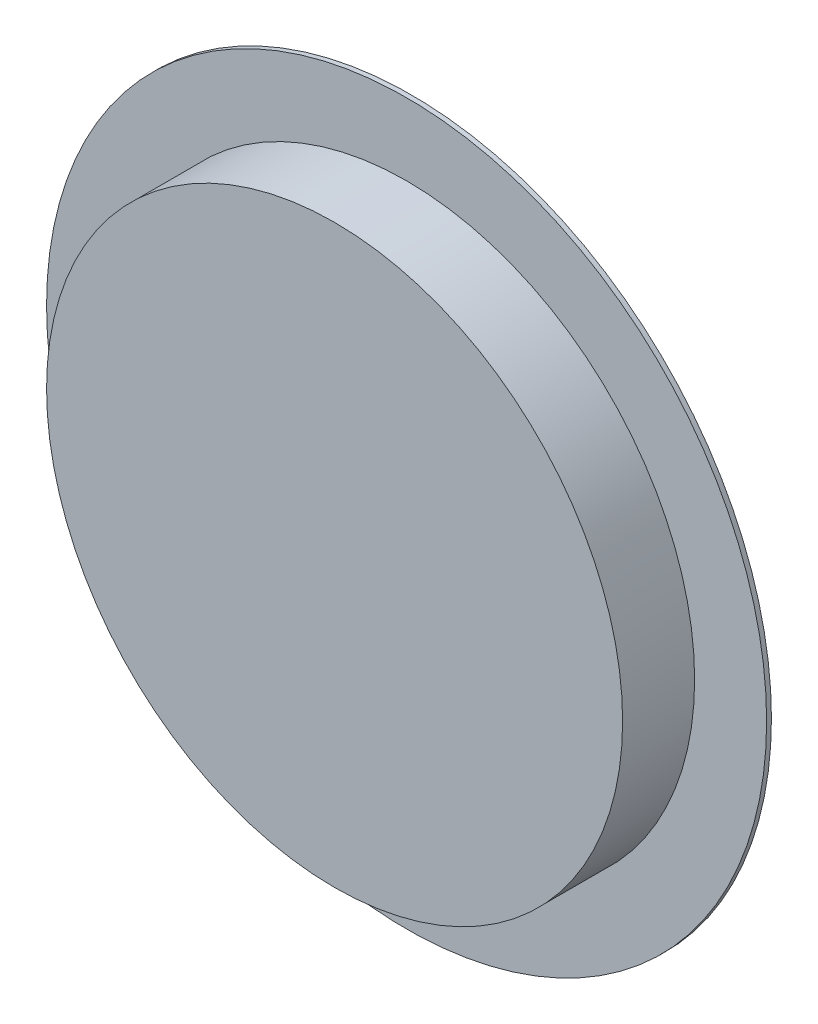
ISO-10303-21;
HEADER;
FILE_DESCRIPTION(('STEP AP214'),'2;1');
FILE_NAME('part.step','',(''),(''),'','','');
FILE_SCHEMA(('AUTOMOTIVE_DESIGN { 1 0 10303 214 1 1 1 1 }'));
ENDSEC;
DATA;
#1=APPLICATION_CONTEXT('core data for automotive mechanical design processes');
#2=APPLICATION_PROTOCOL_DEFINITION('international standard','automotive_design',2000,#1);
#3=PRODUCT_CONTEXT('',#1,'mechanical');
#4=PRODUCT('Part','Part','',(#3));
#5=PRODUCT_RELATED_PRODUCT_CATEGORY('part','',(#4));
#6=PRODUCT_DEFINITION_FORMATION('','',#4);
#7=PRODUCT_DEFINITION_CONTEXT('part definition',#1,'design');
#8=PRODUCT_DEFINITION('design','',#6,#7);
#9=PRODUCT_DEFINITION_SHAPE('','',#8);
#10=(LENGTH_UNIT() NAMED_UNIT(*) SI_UNIT(.MILLI.,.METRE.));
#11=(NAMED_UNIT(*) PLANE_ANGLE_UNIT() SI_UNIT($,.RADIAN.));
#12=(NAMED_UNIT(*) SI_UNIT($,.STERADIAN.) SOLID_ANGLE_UNIT());
#13=UNCERTAINTY_MEASURE_WITH_UNIT(LENGTH_MEASURE(1.E-05),#10,'distance_accuracy_value','');
#14=(GEOMETRIC_REPRESENTATION_CONTEXT(3) GLOBAL_UNCERTAINTY_ASSIGNED_CONTEXT((#13)) GLOBAL_UNIT_ASSIGNED_CONTEXT((#10,
#11,#12)) REPRESENTATION_CONTEXT('',''));
#15=CARTESIAN_POINT('',(0.,0.,0.));
#16=DIRECTION('',(0.,0.,1.));
#17=DIRECTION('',(1.,0.,0.));
#18=AXIS2_PLACEMENT_3D('',#15,#16,#17);
#19=CARTESIAN_POINT('',(0.,0.,1.));
#20=DIRECTION('',(0.,0.,1.));
#21=DIRECTION('',(1.,0.,0.));
#22=AXIS2_PLACEMENT_3D('',#19,#20,#21);
#23=PLANE('',#22);
#24=CARTESIAN_POINT('',(0.,0.,1.));
#25=DIRECTION('',(0.,0.,1.));
#26=DIRECTION('',(1.,0.,0.));
#27=AXIS2_PLACEMENT_3D('',#24,#25,#26);
#28=CIRCLE('',#27,75.);
#29=CARTESIAN_POINT('',(75.,0.,1.));
#30=VERTEX_POINT('',#29);
#31=EDGE_CURVE('E10',#30,#30,#28,.T.);
#32=ORIENTED_EDGE('',*,*,#31,.T.);
#33=EDGE_LOOP('',(#32));
#34=FACE_BOUND('',#33,.T.);
#35=CARTESIAN_POINT('',(0.,0.,1.));
#36=DIRECTION('',(0.,0.,1.));
#37=DIRECTION('',(1.,0.,0.));
#38=AXIS2_PLACEMENT_3D('',#35,#36,#37);
#39=CIRCLE('',#38,60.);
#40=CARTESIAN_POINT('',(60.,0.,1.));
#41=VERTEX_POINT('',#40);
#42=EDGE_CURVE('E45',#41,#41,#39,.T.);
#43=ORIENTED_EDGE('',*,*,#42,.F.);
#44=EDGE_LOOP('',(#43));
#45=FACE_BOUND('',#44,.T.);
#46=ADVANCED_FACE('F32',(#34,#45),#23,.T.);
#47=CARTESIAN_POINT('',(0.,0.,1.));
#48=DIRECTION('',(0.,0.,-1.));
#49=DIRECTION('',(-1.,0.,0.));
#50=AXIS2_PLACEMENT_3D('',#47,#48,#49);
#51=CYLINDRICAL_SURFACE('',#50,75.);
#52=ORIENTED_EDGE('',*,*,#31,.F.);
#53=EDGE_LOOP('',(#52));
#54=FACE_BOUND('',#53,.T.);
#55=CARTESIAN_POINT('',(0.,0.,0.));
#56=DIRECTION('',(0.,0.,1.));
#57=DIRECTION('',(1.,0.,0.));
#58=AXIS2_PLACEMENT_3D('',#55,#56,#57);
#59=CIRCLE('',#58,75.);
#60=CARTESIAN_POINT('',(75.,0.,0.));
#61=VERTEX_POINT('',#60);
#62=EDGE_CURVE('E36',#61,#61,#59,.T.);
#63=ORIENTED_EDGE('',*,*,#62,.T.);
#64=EDGE_LOOP('',(#63));
#65=FACE_BOUND('',#64,.T.);
#66=ADVANCED_FACE('F34',(#54,#65),#51,.T.);
#67=CARTESIAN_POINT('',(0.,0.,0.));
#68=DIRECTION('',(0.,0.,1.));
#69=DIRECTION('',(1.,0.,0.));
#70=AXIS2_PLACEMENT_3D('',#67,#68,#69);
#71=PLANE('',#70);
#72=ORIENTED_EDGE('',*,*,#62,.F.);
#73=EDGE_LOOP('',(#72));
#74=FACE_BOUND('',#73,.T.);
#75=ADVANCED_FACE('F56',(#74),#71,.F.);
#76=CARTESIAN_POINT('',(0.,0.,16.));
#77=DIRECTION('',(0.,0.,-1.));
#78=DIRECTION('',(-1.,0.,0.));
#79=AXIS2_PLACEMENT_3D('',#76,#77,#78);
#80=CYLINDRICAL_SURFACE('',#79,60.);
#81=CARTESIAN_POINT('',(0.,0.,16.));
#82=DIRECTION('',(0.,0.,1.));
#83=DIRECTION('',(1.,0.,0.));
#84=AXIS2_PLACEMENT_3D('',#81,#82,#83);
#85=CIRCLE('',#84,60.);
#86=CARTESIAN_POINT('',(60.,0.,16.));
#87=VERTEX_POINT('',#86);
#88=EDGE_CURVE('E43',#87,#87,#85,.T.);
#89=ORIENTED_EDGE('',*,*,#88,.F.);
#90=EDGE_LOOP('',(#89));
#91=FACE_BOUND('',#90,.T.);
#92=ORIENTED_EDGE('',*,*,#42,.T.);
#93=EDGE_LOOP('',(#92));
#94=FACE_BOUND('',#93,.T.);
#95=ADVANCED_FACE('F53',(#91,#94),#80,.T.);
#96=CARTESIAN_POINT('',(0.,0.,16.));
#97=DIRECTION('',(0.,0.,1.));
#98=DIRECTION('',(1.,0.,0.));
#99=AXIS2_PLACEMENT_3D('',#96,#97,#98);
#100=PLANE('',#99);
#101=ORIENTED_EDGE('',*,*,#88,.T.);
#102=EDGE_LOOP('',(#101));
#103=FACE_BOUND('',#102,.T.);
#104=ADVANCED_FACE('F51',(#103),#100,.T.);
#105=CLOSED_SHELL('',(#46,#66,#75,#95,#104));
#106=MANIFOLD_SOLID_BREP('B2',#105);
#107=ADVANCED_BREP_SHAPE_REPRESENTATION('',(#18,#106),#14);
#108=SHAPE_DEFINITION_REPRESENTATION(#9,#107);
ENDSEC;
END-ISO-10303-21;
